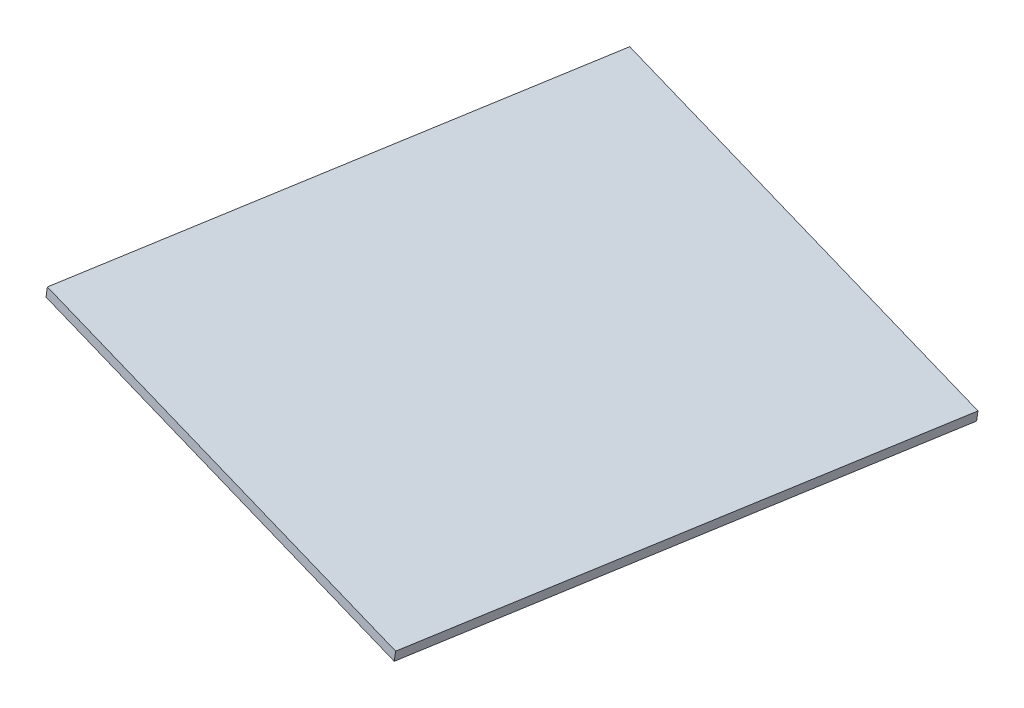
ISO-10303-21;
HEADER;
FILE_DESCRIPTION(('STEP AP214'),'2;1');
FILE_NAME('part.step','',(''),(''),'','','');
FILE_SCHEMA(('AUTOMOTIVE_DESIGN { 1 0 10303 214 1 1 1 1 }'));
ENDSEC;
DATA;
#1=APPLICATION_CONTEXT('core data for automotive mechanical design processes');
#2=APPLICATION_PROTOCOL_DEFINITION('international standard','automotive_design',2000,#1);
#3=PRODUCT_CONTEXT('',#1,'mechanical');
#4=PRODUCT('Part','Part','',(#3));
#5=PRODUCT_RELATED_PRODUCT_CATEGORY('part','',(#4));
#6=PRODUCT_DEFINITION_FORMATION('','',#4);
#7=PRODUCT_DEFINITION_CONTEXT('part definition',#1,'design');
#8=PRODUCT_DEFINITION('design','',#6,#7);
#9=PRODUCT_DEFINITION_SHAPE('','',#8);
#10=(LENGTH_UNIT() NAMED_UNIT(*) SI_UNIT(.MILLI.,.METRE.));
#11=(NAMED_UNIT(*) PLANE_ANGLE_UNIT() SI_UNIT($,.RADIAN.));
#12=(NAMED_UNIT(*) SI_UNIT($,.STERADIAN.) SOLID_ANGLE_UNIT());
#13=UNCERTAINTY_MEASURE_WITH_UNIT(LENGTH_MEASURE(1.E-05),#10,'distance_accuracy_value','');
#14=(GEOMETRIC_REPRESENTATION_CONTEXT(3) GLOBAL_UNCERTAINTY_ASSIGNED_CONTEXT((#13)) GLOBAL_UNIT_ASSIGNED_CONTEXT((#10,
#11,#12)) REPRESENTATION_CONTEXT('',''));
#15=CARTESIAN_POINT('',(0.,0.,0.));
#16=DIRECTION('',(0.,0.,1.));
#17=DIRECTION('',(1.,0.,0.));
#18=AXIS2_PLACEMENT_3D('',#15,#16,#17);
#19=CARTESIAN_POINT('',(306.777273374816,3092.11732687326,823.129392617481));
#20=DIRECTION('',(-0.97245536084359,0.169146641830464,-0.160374513947948));
#21=DIRECTION('',(-0.171364746471442,-0.985207655099562,0.));
#22=AXIS2_PLACEMENT_3D('',#19,#20,#21);
#23=PLANE('',#22);
#24=DIRECTION('',(0.16245270851749,-0.00157226759504738,-0.986715078160834));
#25=VECTOR('',#24,1.);
#26=CARTESIAN_POINT('',(306.275818294119,3089.1605579486,823.051544507329));
#27=LINE('',#26,#25);
#28=CARTESIAN_POINT('',(306.275818294119,3089.1605579486,823.051544507329));
#29=VERTEX_POINT('',#28);
#30=CARTESIAN_POINT('',(331.232145758704,3088.91902288697,671.470294619005));
#31=VERTEX_POINT('',#30);
#32=EDGE_CURVE('E97',#29,#31,#27,.T.);
#33=ORIENTED_EDGE('',*,*,#32,.F.);
#34=DIRECTION('',(-0.167151693565741,-0.985589641550725,-0.0259493700505117));
#35=VECTOR('',#34,1.);
#36=CARTESIAN_POINT('',(306.777273374816,3092.11732687326,823.129392617481));
#37=LINE('',#36,#35);
#38=CARTESIAN_POINT('',(306.777273374816,3092.11732687326,823.129392617481));
#39=VERTEX_POINT('',#38);
#40=EDGE_CURVE('E11',#39,#29,#37,.T.);
#41=ORIENTED_EDGE('',*,*,#40,.F.);
#42=DIRECTION('',(0.16245270851749,-0.00157226759504738,-0.986715078160834));
#43=VECTOR('',#42,1.);
#44=CARTESIAN_POINT('',(306.777273374816,3092.11732687326,823.129392617481));
#45=LINE('',#44,#43);
#46=CARTESIAN_POINT('',(331.733600839401,3091.87579181162,671.548142729157));
#47=VERTEX_POINT('',#46);
#48=EDGE_CURVE('E91',#39,#47,#45,.T.);
#49=ORIENTED_EDGE('',*,*,#48,.T.);
#50=DIRECTION('',(-0.167151693565741,-0.985589641550725,-0.0259493700505117));
#51=VECTOR('',#50,1.);
#52=CARTESIAN_POINT('',(331.733600839401,3091.87579181162,671.548142729157));
#53=LINE('',#52,#51);
#54=EDGE_CURVE('E36',#47,#31,#53,.T.);
#55=ORIENTED_EDGE('',*,*,#54,.T.);
#56=EDGE_LOOP('',(#33,#41,#49,#55));
#57=FACE_BOUND('',#56,.T.);
#58=ADVANCED_FACE('F33',(#57),#23,.T.);
#59=CARTESIAN_POINT('',(306.777273374816,3092.11732687326,823.129392617481));
#60=DIRECTION('',(-0.162452708517468,0.00157226759504405,0.986715078160838));
#61=DIRECTION('',(0.986716297755462,0.,0.162452909311451));
#62=AXIS2_PLACEMENT_3D('',#59,#60,#61);
#63=PLANE('',#62);
#64=DIRECTION('',(-0.972455360843593,0.169146641830464,-0.160374513947926));
#65=VECTOR('',#64,1.);
#66=CARTESIAN_POINT('',(306.275818294119,3089.1605579486,823.051544507329));
#67=LINE('',#66,#65);
#68=CARTESIAN_POINT('',(432.695015203786,3067.17149451064,843.90023132056));
#69=VERTEX_POINT('',#68);
#70=EDGE_CURVE('E93',#69,#29,#67,.T.);
#71=ORIENTED_EDGE('',*,*,#70,.F.);
#72=DIRECTION('',(-0.167151693565741,-0.985589641550725,-0.0259493700505117));
#73=VECTOR('',#72,1.);
#74=CARTESIAN_POINT('',(433.196470284483,3070.1282634353,843.978079430711));
#75=LINE('',#74,#73);
#76=CARTESIAN_POINT('',(433.196470284483,3070.1282634353,843.978079430711));
#77=VERTEX_POINT('',#76);
#78=EDGE_CURVE('E42',#77,#69,#75,.T.);
#79=ORIENTED_EDGE('',*,*,#78,.F.);
#80=DIRECTION('',(-0.972455360843593,0.169146641830464,-0.160374513947926));
#81=VECTOR('',#80,1.);
#82=CARTESIAN_POINT('',(306.777273374816,3092.11732687326,823.129392617481));
#83=LINE('',#82,#81);
#84=EDGE_CURVE('E88',#77,#39,#83,.T.);
#85=ORIENTED_EDGE('',*,*,#84,.T.);
#86=ORIENTED_EDGE('',*,*,#40,.T.);
#87=EDGE_LOOP('',(#71,#79,#85,#86));
#88=FACE_BOUND('',#87,.T.);
#89=ADVANCED_FACE('F107',(#88),#63,.T.);
#90=CARTESIAN_POINT('',(433.196470284483,3070.1282634353,843.978079430711));
#91=DIRECTION('',(0.97245536084359,-0.169146641830464,0.160374513947948));
#92=DIRECTION('',(0.171364746471442,0.985207655099562,0.));
#93=AXIS2_PLACEMENT_3D('',#90,#91,#92);
#94=PLANE('',#93);
#95=DIRECTION('',(-0.16245270851749,0.00157226759504741,0.986715078160834));
#96=VECTOR('',#95,1.);
#97=CARTESIAN_POINT('',(432.695015203786,3067.17149451064,843.90023132056));
#98=LINE('',#97,#96);
#99=CARTESIAN_POINT('',(457.65134266837,3066.92995944901,692.318981432239));
#100=VERTEX_POINT('',#99);
#101=EDGE_CURVE('E83',#100,#69,#98,.T.);
#102=ORIENTED_EDGE('',*,*,#101,.F.);
#103=DIRECTION('',(-0.167151693565741,-0.985589641550725,-0.0259493700505117));
#104=VECTOR('',#103,1.);
#105=CARTESIAN_POINT('',(458.152797749067,3069.88672837366,692.39682954239));
#106=LINE('',#105,#104);
#107=CARTESIAN_POINT('',(458.152797749067,3069.88672837366,692.39682954239));
#108=VERTEX_POINT('',#107);
#109=EDGE_CURVE('E78',#108,#100,#106,.T.);
#110=ORIENTED_EDGE('',*,*,#109,.F.);
#111=DIRECTION('',(-0.16245270851749,0.00157226759504741,0.986715078160834));
#112=VECTOR('',#111,1.);
#113=CARTESIAN_POINT('',(433.196470284483,3070.1282634353,843.978079430711));
#114=LINE('',#113,#112);
#115=EDGE_CURVE('E81',#108,#77,#114,.T.);
#116=ORIENTED_EDGE('',*,*,#115,.T.);
#117=ORIENTED_EDGE('',*,*,#78,.T.);
#118=EDGE_LOOP('',(#102,#110,#116,#117));
#119=FACE_BOUND('',#118,.T.);
#120=ADVANCED_FACE('F80',(#119),#94,.T.);
#121=CARTESIAN_POINT('',(331.733600839401,3091.87579181162,671.548142729157));
#122=DIRECTION('',(0.162452708517491,-0.001572267595048,-0.986715078160834));
#123=DIRECTION('',(-0.986716297755458,0.,-0.162452909311473));
#124=AXIS2_PLACEMENT_3D('',#121,#122,#123);
#125=PLANE('',#124);
#126=DIRECTION('',(0.972455360843589,-0.169146641830464,0.160374513947949));
#127=VECTOR('',#126,1.);
#128=CARTESIAN_POINT('',(331.232145758704,3088.91902288697,671.470294619005));
#129=LINE('',#128,#127);
#130=EDGE_CURVE('E100',#31,#100,#129,.T.);
#131=ORIENTED_EDGE('',*,*,#130,.F.);
#132=ORIENTED_EDGE('',*,*,#54,.F.);
#133=DIRECTION('',(0.972455360843589,-0.169146641830464,0.160374513947949));
#134=VECTOR('',#133,1.);
#135=CARTESIAN_POINT('',(331.733600839401,3091.87579181162,671.548142729157));
#136=LINE('',#135,#134);
#137=EDGE_CURVE('E87',#47,#108,#136,.T.);
#138=ORIENTED_EDGE('',*,*,#137,.T.);
#139=ORIENTED_EDGE('',*,*,#109,.T.);
#140=EDGE_LOOP('',(#131,#132,#138,#139));
#141=FACE_BOUND('',#140,.T.);
#142=ADVANCED_FACE('F90',(#141),#125,.T.);
#143=CARTESIAN_POINT('',(521.546185701144,3075.23368296099,80.967142375194));
#144=DIRECTION('',(-0.16715169356574,-0.985589641550725,-0.0259493700505121));
#145=DIRECTION('',(0.985921642382511,-0.167207999455087,0.));
#146=AXIS2_PLACEMENT_3D('',#143,#144,#145);
#147=PLANE('',#146);
#148=ORIENTED_EDGE('',*,*,#48,.F.);
#149=ORIENTED_EDGE('',*,*,#84,.F.);
#150=ORIENTED_EDGE('',*,*,#115,.F.);
#151=ORIENTED_EDGE('',*,*,#137,.F.);
#152=EDGE_LOOP('',(#148,#149,#150,#151));
#153=FACE_BOUND('',#152,.T.);
#154=ADVANCED_FACE('F86',(#153),#147,.F.);
#155=CARTESIAN_POINT('',(521.044730620447,3072.27691403634,80.8892942650425));
#156=DIRECTION('',(-0.16715169356574,-0.985589641550725,-0.0259493700505121));
#157=DIRECTION('',(0.985921642382511,-0.167207999455087,0.));
#158=AXIS2_PLACEMENT_3D('',#155,#156,#157);
#159=PLANE('',#158);
#160=ORIENTED_EDGE('',*,*,#32,.T.);
#161=ORIENTED_EDGE('',*,*,#130,.T.);
#162=ORIENTED_EDGE('',*,*,#101,.T.);
#163=ORIENTED_EDGE('',*,*,#70,.T.);
#164=EDGE_LOOP('',(#160,#161,#162,#163));
#165=FACE_BOUND('',#164,.T.);
#166=ADVANCED_FACE('F106',(#165),#159,.T.);
#167=CLOSED_SHELL('',(#58,#89,#120,#142,#154,#166));
#168=MANIFOLD_SOLID_BREP('B2',#167);
#169=ADVANCED_BREP_SHAPE_REPRESENTATION('',(#18,#168),#14);
#170=SHAPE_DEFINITION_REPRESENTATION(#9,#169);
ENDSEC;
END-ISO-10303-21;
